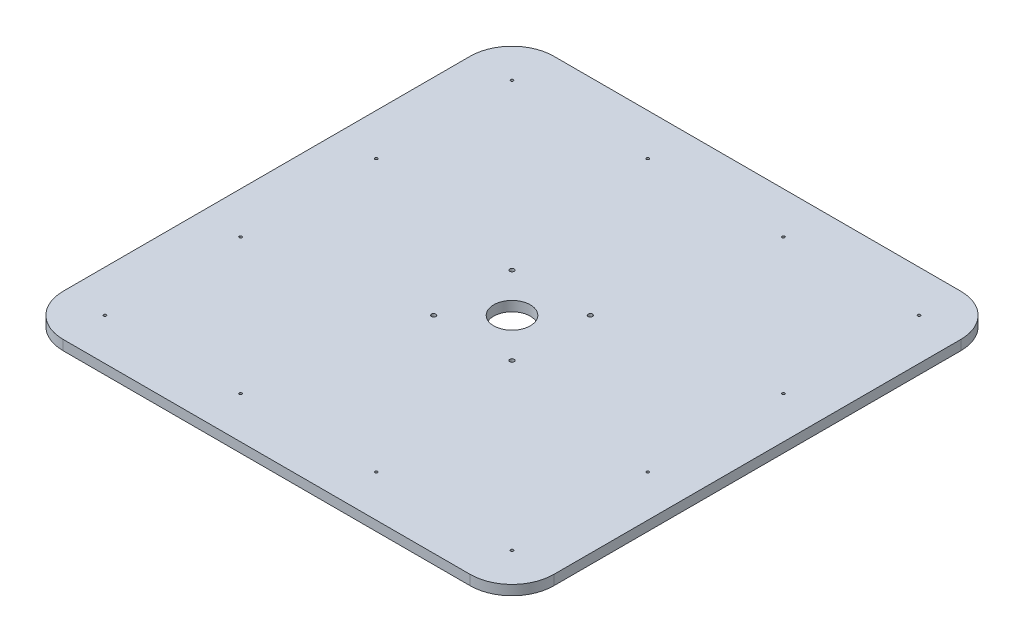
ISO-10303-21;
HEADER;
FILE_DESCRIPTION(('STEP AP214'),'2;1');
FILE_NAME('part.step','',(''),(''),'','','');
FILE_SCHEMA(('AUTOMOTIVE_DESIGN { 1 0 10303 214 1 1 1 1 }'));
ENDSEC;
DATA;
#1=APPLICATION_CONTEXT('core data for automotive mechanical design processes');
#2=APPLICATION_PROTOCOL_DEFINITION('international standard','automotive_design',2000,#1);
#3=PRODUCT_CONTEXT('',#1,'mechanical');
#4=PRODUCT('Part','Part','',(#3));
#5=PRODUCT_RELATED_PRODUCT_CATEGORY('part','',(#4));
#6=PRODUCT_DEFINITION_FORMATION('','',#4);
#7=PRODUCT_DEFINITION_CONTEXT('part definition',#1,'design');
#8=PRODUCT_DEFINITION('design','',#6,#7);
#9=PRODUCT_DEFINITION_SHAPE('','',#8);
#10=(LENGTH_UNIT() NAMED_UNIT(*) SI_UNIT(.MILLI.,.METRE.));
#11=(NAMED_UNIT(*) PLANE_ANGLE_UNIT() SI_UNIT($,.RADIAN.));
#12=(NAMED_UNIT(*) SI_UNIT($,.STERADIAN.) SOLID_ANGLE_UNIT());
#13=UNCERTAINTY_MEASURE_WITH_UNIT(LENGTH_MEASURE(1.E-05),#10,'distance_accuracy_value','');
#14=(GEOMETRIC_REPRESENTATION_CONTEXT(3) GLOBAL_UNCERTAINTY_ASSIGNED_CONTEXT((#13)) GLOBAL_UNIT_ASSIGNED_CONTEXT((#10,
#11,#12)) REPRESENTATION_CONTEXT('',''));
#15=CARTESIAN_POINT('',(0.,0.,0.));
#16=DIRECTION('',(0.,0.,1.));
#17=DIRECTION('',(1.,0.,0.));
#18=AXIS2_PLACEMENT_3D('',#15,#16,#17);
#19=CARTESIAN_POINT('',(0.,12.,0.));
#20=DIRECTION('',(0.,1.,0.));
#21=DIRECTION('',(0.,0.,1.));
#22=AXIS2_PLACEMENT_3D('',#19,#20,#21);
#23=PLANE('',#22);
#24=CARTESIAN_POINT('',(0.,12.,1.11022302462516E-13));
#25=DIRECTION('',(0.,-1.,0.));
#26=DIRECTION('',(0.,0.,-1.));
#27=AXIS2_PLACEMENT_3D('',#24,#25,#26);
#28=CIRCLE('',#27,22.225);
#29=CARTESIAN_POINT('',(0.,12.,-22.2249999999999));
#30=VERTEX_POINT('',#29);
#31=EDGE_CURVE('E110',#30,#30,#28,.T.);
#32=ORIENTED_EDGE('',*,*,#31,.T.);
#33=EDGE_LOOP('',(#32));
#34=FACE_BOUND('',#33,.T.);
#35=DIRECTION('',(0.,0.,1.));
#36=VECTOR('',#35,1.);
#37=CARTESIAN_POINT('',(298.45,12.,298.45));
#38=LINE('',#37,#36);
#39=CARTESIAN_POINT('',(298.45,12.,247.65));
#40=VERTEX_POINT('',#39);
#41=CARTESIAN_POINT('',(298.45,12.,-247.65));
#42=VERTEX_POINT('',#41);
#43=EDGE_CURVE('E116',#40,#42,#38,.F.);
#44=ORIENTED_EDGE('',*,*,#43,.T.);
#45=CARTESIAN_POINT('',(247.65,12.,-247.65));
#46=DIRECTION('',(0.,-1.,0.));
#47=DIRECTION('',(0.,0.,-1.));
#48=AXIS2_PLACEMENT_3D('',#45,#46,#47);
#49=CIRCLE('',#48,50.8);
#50=CARTESIAN_POINT('',(247.65,12.,-298.45));
#51=VERTEX_POINT('',#50);
#52=EDGE_CURVE('E117',#51,#42,#49,.T.);
#53=ORIENTED_EDGE('',*,*,#52,.F.);
#54=DIRECTION('',(1.,0.,0.));
#55=VECTOR('',#54,1.);
#56=CARTESIAN_POINT('',(298.45,12.,-298.45));
#57=LINE('',#56,#55);
#58=CARTESIAN_POINT('',(-247.65,12.,-298.45));
#59=VERTEX_POINT('',#58);
#60=EDGE_CURVE('E111',#51,#59,#57,.F.);
#61=ORIENTED_EDGE('',*,*,#60,.T.);
#62=CARTESIAN_POINT('',(-247.65,12.,-247.65));
#63=DIRECTION('',(0.,-1.,0.));
#64=DIRECTION('',(0.,0.,-1.));
#65=AXIS2_PLACEMENT_3D('',#62,#63,#64);
#66=CIRCLE('',#65,50.8);
#67=CARTESIAN_POINT('',(-298.45,12.,-247.65));
#68=VERTEX_POINT('',#67);
#69=EDGE_CURVE('E114',#68,#59,#66,.T.);
#70=ORIENTED_EDGE('',*,*,#69,.F.);
#71=DIRECTION('',(0.,0.,-1.));
#72=VECTOR('',#71,1.);
#73=CARTESIAN_POINT('',(-298.45,12.,298.45));
#74=LINE('',#73,#72);
#75=CARTESIAN_POINT('',(-298.45,12.,247.65));
#76=VERTEX_POINT('',#75);
#77=EDGE_CURVE('E87',#68,#76,#74,.F.);
#78=ORIENTED_EDGE('',*,*,#77,.T.);
#79=CARTESIAN_POINT('',(-247.65,12.,247.65));
#80=DIRECTION('',(0.,-1.,0.));
#81=DIRECTION('',(0.,0.,-1.));
#82=AXIS2_PLACEMENT_3D('',#79,#80,#81);
#83=CIRCLE('',#82,50.8);
#84=CARTESIAN_POINT('',(-247.65,12.,298.45));
#85=VERTEX_POINT('',#84);
#86=EDGE_CURVE('E81',#85,#76,#83,.T.);
#87=ORIENTED_EDGE('',*,*,#86,.F.);
#88=DIRECTION('',(-1.,0.,0.));
#89=VECTOR('',#88,1.);
#90=CARTESIAN_POINT('',(298.45,12.,298.45));
#91=LINE('',#90,#89);
#92=CARTESIAN_POINT('',(247.65,12.,298.45));
#93=VERTEX_POINT('',#92);
#94=EDGE_CURVE('E85',#85,#93,#91,.F.);
#95=ORIENTED_EDGE('',*,*,#94,.T.);
#96=CARTESIAN_POINT('',(247.65,12.,247.65));
#97=DIRECTION('',(0.,-1.,0.));
#98=DIRECTION('',(0.,0.,-1.));
#99=AXIS2_PLACEMENT_3D('',#96,#97,#98);
#100=CIRCLE('',#99,50.8);
#101=EDGE_CURVE('E100',#40,#93,#100,.T.);
#102=ORIENTED_EDGE('',*,*,#101,.F.);
#103=EDGE_LOOP('',(#44,#53,#61,#70,#78,#87,#95,#102));
#104=FACE_BOUND('',#103,.T.);
#105=CARTESIAN_POINT('',(-247.65,12.,247.65));
#106=DIRECTION('',(0.,-1.,0.));
#107=DIRECTION('',(0.,0.,-1.));
#108=AXIS2_PLACEMENT_3D('',#105,#106,#107);
#109=CIRCLE('',#108,1.65100000000001);
#110=CARTESIAN_POINT('',(-247.65,12.,245.999));
#111=VERTEX_POINT('',#110);
#112=EDGE_CURVE('E93',#111,#111,#109,.T.);
#113=ORIENTED_EDGE('',*,*,#112,.T.);
#114=EDGE_LOOP('',(#113));
#115=FACE_BOUND('',#114,.T.);
#116=CARTESIAN_POINT('',(-82.55,12.,247.65));
#117=DIRECTION('',(0.,-1.,0.));
#118=DIRECTION('',(0.,0.,-1.));
#119=AXIS2_PLACEMENT_3D('',#116,#117,#118);
#120=CIRCLE('',#119,1.65100000000001);
#121=CARTESIAN_POINT('',(-82.55,12.,245.999));
#122=VERTEX_POINT('',#121);
#123=EDGE_CURVE('E190',#122,#122,#120,.T.);
#124=ORIENTED_EDGE('',*,*,#123,.T.);
#125=EDGE_LOOP('',(#124));
#126=FACE_BOUND('',#125,.T.);
#127=CARTESIAN_POINT('',(82.55,12.,247.65));
#128=DIRECTION('',(0.,-1.,0.));
#129=DIRECTION('',(0.,0.,-1.));
#130=AXIS2_PLACEMENT_3D('',#127,#128,#129);
#131=CIRCLE('',#130,1.65100000000001);
#132=CARTESIAN_POINT('',(82.55,12.,245.999));
#133=VERTEX_POINT('',#132);
#134=EDGE_CURVE('E193',#133,#133,#131,.T.);
#135=ORIENTED_EDGE('',*,*,#134,.T.);
#136=EDGE_LOOP('',(#135));
#137=FACE_BOUND('',#136,.T.);
#138=CARTESIAN_POINT('',(247.65,12.,247.65));
#139=DIRECTION('',(0.,-1.,0.));
#140=DIRECTION('',(0.,0.,-1.));
#141=AXIS2_PLACEMENT_3D('',#138,#139,#140);
#142=CIRCLE('',#141,1.65100000000001);
#143=CARTESIAN_POINT('',(247.65,12.,245.999));
#144=VERTEX_POINT('',#143);
#145=EDGE_CURVE('E196',#144,#144,#142,.T.);
#146=ORIENTED_EDGE('',*,*,#145,.T.);
#147=EDGE_LOOP('',(#146));
#148=FACE_BOUND('',#147,.T.);
#149=CARTESIAN_POINT('',(247.65,12.,-82.5499999999999));
#150=DIRECTION('',(0.,-1.,0.));
#151=DIRECTION('',(0.,0.,-1.));
#152=AXIS2_PLACEMENT_3D('',#149,#150,#151);
#153=CIRCLE('',#152,1.65100000000001);
#154=CARTESIAN_POINT('',(247.65,12.,-84.2009999999999));
#155=VERTEX_POINT('',#154);
#156=EDGE_CURVE('E199',#155,#155,#153,.T.);
#157=ORIENTED_EDGE('',*,*,#156,.T.);
#158=EDGE_LOOP('',(#157));
#159=FACE_BOUND('',#158,.T.);
#160=CARTESIAN_POINT('',(247.65,12.,82.5499999999999));
#161=DIRECTION('',(0.,-1.,0.));
#162=DIRECTION('',(0.,0.,-1.));
#163=AXIS2_PLACEMENT_3D('',#160,#161,#162);
#164=CIRCLE('',#163,1.65100000000001);
#165=CARTESIAN_POINT('',(247.65,12.,80.8989999999999));
#166=VERTEX_POINT('',#165);
#167=EDGE_CURVE('E202',#166,#166,#164,.T.);
#168=ORIENTED_EDGE('',*,*,#167,.T.);
#169=EDGE_LOOP('',(#168));
#170=FACE_BOUND('',#169,.T.);
#171=CARTESIAN_POINT('',(247.65,12.,-247.65));
#172=DIRECTION('',(0.,-1.,0.));
#173=DIRECTION('',(0.,0.,-1.));
#174=AXIS2_PLACEMENT_3D('',#171,#172,#173);
#175=CIRCLE('',#174,1.65100000000001);
#176=CARTESIAN_POINT('',(247.65,12.,-249.301));
#177=VERTEX_POINT('',#176);
#178=EDGE_CURVE('E205',#177,#177,#175,.T.);
#179=ORIENTED_EDGE('',*,*,#178,.T.);
#180=EDGE_LOOP('',(#179));
#181=FACE_BOUND('',#180,.T.);
#182=CARTESIAN_POINT('',(82.55,12.,-247.65));
#183=DIRECTION('',(0.,-1.,0.));
#184=DIRECTION('',(0.,0.,-1.));
#185=AXIS2_PLACEMENT_3D('',#182,#183,#184);
#186=CIRCLE('',#185,1.65100000000001);
#187=CARTESIAN_POINT('',(82.55,12.,-249.301));
#188=VERTEX_POINT('',#187);
#189=EDGE_CURVE('E208',#188,#188,#186,.T.);
#190=ORIENTED_EDGE('',*,*,#189,.T.);
#191=EDGE_LOOP('',(#190));
#192=FACE_BOUND('',#191,.T.);
#193=CARTESIAN_POINT('',(-82.55,12.,-247.65));
#194=DIRECTION('',(0.,-1.,0.));
#195=DIRECTION('',(0.,0.,-1.));
#196=AXIS2_PLACEMENT_3D('',#193,#194,#195);
#197=CIRCLE('',#196,1.65100000000001);
#198=CARTESIAN_POINT('',(-82.55,12.,-249.301));
#199=VERTEX_POINT('',#198);
#200=EDGE_CURVE('E211',#199,#199,#197,.T.);
#201=ORIENTED_EDGE('',*,*,#200,.T.);
#202=EDGE_LOOP('',(#201));
#203=FACE_BOUND('',#202,.T.);
#204=CARTESIAN_POINT('',(-247.65,12.,-247.65));
#205=DIRECTION('',(0.,-1.,0.));
#206=DIRECTION('',(0.,0.,-1.));
#207=AXIS2_PLACEMENT_3D('',#204,#205,#206);
#208=CIRCLE('',#207,1.65100000000001);
#209=CARTESIAN_POINT('',(-247.65,12.,-249.301));
#210=VERTEX_POINT('',#209);
#211=EDGE_CURVE('E214',#210,#210,#208,.T.);
#212=ORIENTED_EDGE('',*,*,#211,.T.);
#213=EDGE_LOOP('',(#212));
#214=FACE_BOUND('',#213,.T.);
#215=CARTESIAN_POINT('',(-247.65,12.,-82.5499999999999));
#216=DIRECTION('',(0.,-1.,0.));
#217=DIRECTION('',(0.,0.,-1.));
#218=AXIS2_PLACEMENT_3D('',#215,#216,#217);
#219=CIRCLE('',#218,1.65100000000001);
#220=CARTESIAN_POINT('',(-247.65,12.,-84.2009999999999));
#221=VERTEX_POINT('',#220);
#222=EDGE_CURVE('E217',#221,#221,#219,.T.);
#223=ORIENTED_EDGE('',*,*,#222,.T.);
#224=EDGE_LOOP('',(#223));
#225=FACE_BOUND('',#224,.T.);
#226=CARTESIAN_POINT('',(-247.65,12.,82.5499999999999));
#227=DIRECTION('',(0.,-1.,0.));
#228=DIRECTION('',(0.,0.,-1.));
#229=AXIS2_PLACEMENT_3D('',#226,#227,#228);
#230=CIRCLE('',#229,1.65100000000001);
#231=CARTESIAN_POINT('',(-247.65,12.,80.8989999999999));
#232=VERTEX_POINT('',#231);
#233=EDGE_CURVE('E220',#232,#232,#230,.T.);
#234=ORIENTED_EDGE('',*,*,#233,.T.);
#235=EDGE_LOOP('',(#234));
#236=FACE_BOUND('',#235,.T.);
#237=CARTESIAN_POINT('',(-47.625,12.,-47.625));
#238=DIRECTION('',(0.,-1.,0.));
#239=DIRECTION('',(0.,0.,-1.));
#240=AXIS2_PLACEMENT_3D('',#237,#238,#239);
#241=CIRCLE('',#240,2.667);
#242=CARTESIAN_POINT('',(-47.625,12.,-50.292));
#243=VERTEX_POINT('',#242);
#244=EDGE_CURVE('E223',#243,#243,#241,.T.);
#245=ORIENTED_EDGE('',*,*,#244,.T.);
#246=EDGE_LOOP('',(#245));
#247=FACE_BOUND('',#246,.T.);
#248=CARTESIAN_POINT('',(47.625,12.,-47.625));
#249=DIRECTION('',(0.,-1.,0.));
#250=DIRECTION('',(0.,0.,-1.));
#251=AXIS2_PLACEMENT_3D('',#248,#249,#250);
#252=CIRCLE('',#251,2.667);
#253=CARTESIAN_POINT('',(47.625,12.,-50.292));
#254=VERTEX_POINT('',#253);
#255=EDGE_CURVE('E226',#254,#254,#252,.T.);
#256=ORIENTED_EDGE('',*,*,#255,.T.);
#257=EDGE_LOOP('',(#256));
#258=FACE_BOUND('',#257,.T.);
#259=CARTESIAN_POINT('',(47.625,12.,47.625));
#260=DIRECTION('',(0.,-1.,0.));
#261=DIRECTION('',(0.,0.,-1.));
#262=AXIS2_PLACEMENT_3D('',#259,#260,#261);
#263=CIRCLE('',#262,2.667);
#264=CARTESIAN_POINT('',(47.625,12.,44.958));
#265=VERTEX_POINT('',#264);
#266=EDGE_CURVE('E228',#265,#265,#263,.T.);
#267=ORIENTED_EDGE('',*,*,#266,.T.);
#268=EDGE_LOOP('',(#267));
#269=FACE_BOUND('',#268,.T.);
#270=CARTESIAN_POINT('',(-47.625,12.,47.625));
#271=DIRECTION('',(0.,-1.,0.));
#272=DIRECTION('',(0.,0.,-1.));
#273=AXIS2_PLACEMENT_3D('',#270,#271,#272);
#274=CIRCLE('',#273,2.667);
#275=CARTESIAN_POINT('',(-47.625,12.,44.958));
#276=VERTEX_POINT('',#275);
#277=EDGE_CURVE('E20',#276,#276,#274,.T.);
#278=ORIENTED_EDGE('',*,*,#277,.T.);
#279=EDGE_LOOP('',(#278));
#280=FACE_BOUND('',#279,.T.);
#281=ADVANCED_FACE('F17',(#34,#104,#115,#126,#137,#148,#159,#170,#181,#192,#203,#214,#225,#236,
#247,#258,#269,#280),#23,.T.);
#282=CARTESIAN_POINT('',(-47.625,12.,47.625));
#283=DIRECTION('',(0.,-1.,0.));
#284=DIRECTION('',(0.,0.,-1.));
#285=AXIS2_PLACEMENT_3D('',#282,#283,#284);
#286=CYLINDRICAL_SURFACE('',#285,2.667);
#287=ORIENTED_EDGE('',*,*,#277,.F.);
#288=EDGE_LOOP('',(#287));
#289=FACE_BOUND('',#288,.T.);
#290=CARTESIAN_POINT('',(-47.625,0.,47.625));
#291=DIRECTION('',(0.,-1.,0.));
#292=DIRECTION('',(0.,0.,-1.));
#293=AXIS2_PLACEMENT_3D('',#290,#291,#292);
#294=CIRCLE('',#293,2.667);
#295=CARTESIAN_POINT('',(-47.625,0.,44.958));
#296=VERTEX_POINT('',#295);
#297=EDGE_CURVE('E178',#296,#296,#294,.T.);
#298=ORIENTED_EDGE('',*,*,#297,.T.);
#299=EDGE_LOOP('',(#298));
#300=FACE_BOUND('',#299,.T.);
#301=ADVANCED_FACE('F236',(#289,#300),#286,.F.);
#302=CARTESIAN_POINT('',(47.625,12.,47.625));
#303=DIRECTION('',(0.,-1.,0.));
#304=DIRECTION('',(0.,0.,-1.));
#305=AXIS2_PLACEMENT_3D('',#302,#303,#304);
#306=CYLINDRICAL_SURFACE('',#305,2.667);
#307=ORIENTED_EDGE('',*,*,#266,.F.);
#308=EDGE_LOOP('',(#307));
#309=FACE_BOUND('',#308,.T.);
#310=CARTESIAN_POINT('',(47.625,0.,47.625));
#311=DIRECTION('',(0.,-1.,0.));
#312=DIRECTION('',(0.,0.,-1.));
#313=AXIS2_PLACEMENT_3D('',#310,#311,#312);
#314=CIRCLE('',#313,2.667);
#315=CARTESIAN_POINT('',(47.625,0.,44.958));
#316=VERTEX_POINT('',#315);
#317=EDGE_CURVE('E175',#316,#316,#314,.T.);
#318=ORIENTED_EDGE('',*,*,#317,.T.);
#319=EDGE_LOOP('',(#318));
#320=FACE_BOUND('',#319,.T.);
#321=ADVANCED_FACE('F239',(#309,#320),#306,.F.);
#322=CARTESIAN_POINT('',(47.625,12.,-47.625));
#323=DIRECTION('',(0.,-1.,0.));
#324=DIRECTION('',(0.,0.,-1.));
#325=AXIS2_PLACEMENT_3D('',#322,#323,#324);
#326=CYLINDRICAL_SURFACE('',#325,2.667);
#327=ORIENTED_EDGE('',*,*,#255,.F.);
#328=EDGE_LOOP('',(#327));
#329=FACE_BOUND('',#328,.T.);
#330=CARTESIAN_POINT('',(47.625,0.,-47.625));
#331=DIRECTION('',(0.,-1.,0.));
#332=DIRECTION('',(0.,0.,-1.));
#333=AXIS2_PLACEMENT_3D('',#330,#331,#332);
#334=CIRCLE('',#333,2.667);
#335=CARTESIAN_POINT('',(47.625,0.,-50.292));
#336=VERTEX_POINT('',#335);
#337=EDGE_CURVE('E172',#336,#336,#334,.T.);
#338=ORIENTED_EDGE('',*,*,#337,.T.);
#339=EDGE_LOOP('',(#338));
#340=FACE_BOUND('',#339,.T.);
#341=ADVANCED_FACE('F334',(#329,#340),#326,.F.);
#342=CARTESIAN_POINT('',(-47.625,12.,-47.625));
#343=DIRECTION('',(0.,-1.,0.));
#344=DIRECTION('',(0.,0.,-1.));
#345=AXIS2_PLACEMENT_3D('',#342,#343,#344);
#346=CYLINDRICAL_SURFACE('',#345,2.667);
#347=ORIENTED_EDGE('',*,*,#244,.F.);
#348=EDGE_LOOP('',(#347));
#349=FACE_BOUND('',#348,.T.);
#350=CARTESIAN_POINT('',(-47.625,0.,-47.625));
#351=DIRECTION('',(0.,-1.,0.));
#352=DIRECTION('',(0.,0.,-1.));
#353=AXIS2_PLACEMENT_3D('',#350,#351,#352);
#354=CIRCLE('',#353,2.667);
#355=CARTESIAN_POINT('',(-47.625,0.,-50.292));
#356=VERTEX_POINT('',#355);
#357=EDGE_CURVE('E169',#356,#356,#354,.T.);
#358=ORIENTED_EDGE('',*,*,#357,.T.);
#359=EDGE_LOOP('',(#358));
#360=FACE_BOUND('',#359,.T.);
#361=ADVANCED_FACE('F330',(#349,#360),#346,.F.);
#362=CARTESIAN_POINT('',(-247.65,12.,82.5499999999999));
#363=DIRECTION('',(0.,-1.,0.));
#364=DIRECTION('',(0.,0.,-1.));
#365=AXIS2_PLACEMENT_3D('',#362,#363,#364);
#366=CYLINDRICAL_SURFACE('',#365,1.65100000000001);
#367=ORIENTED_EDGE('',*,*,#233,.F.);
#368=EDGE_LOOP('',(#367));
#369=FACE_BOUND('',#368,.T.);
#370=CARTESIAN_POINT('',(-247.65,0.,82.5499999999999));
#371=DIRECTION('',(0.,-1.,0.));
#372=DIRECTION('',(0.,0.,-1.));
#373=AXIS2_PLACEMENT_3D('',#370,#371,#372);
#374=CIRCLE('',#373,1.65100000000001);
#375=CARTESIAN_POINT('',(-247.65,0.,80.8989999999999));
#376=VERTEX_POINT('',#375);
#377=EDGE_CURVE('E166',#376,#376,#374,.T.);
#378=ORIENTED_EDGE('',*,*,#377,.T.);
#379=EDGE_LOOP('',(#378));
#380=FACE_BOUND('',#379,.T.);
#381=ADVANCED_FACE('F326',(#369,#380),#366,.F.);
#382=CARTESIAN_POINT('',(-247.65,12.,-82.5499999999999));
#383=DIRECTION('',(0.,-1.,0.));
#384=DIRECTION('',(0.,0.,-1.));
#385=AXIS2_PLACEMENT_3D('',#382,#383,#384);
#386=CYLINDRICAL_SURFACE('',#385,1.65100000000001);
#387=ORIENTED_EDGE('',*,*,#222,.F.);
#388=EDGE_LOOP('',(#387));
#389=FACE_BOUND('',#388,.T.);
#390=CARTESIAN_POINT('',(-247.65,0.,-82.5499999999999));
#391=DIRECTION('',(0.,-1.,0.));
#392=DIRECTION('',(0.,0.,-1.));
#393=AXIS2_PLACEMENT_3D('',#390,#391,#392);
#394=CIRCLE('',#393,1.65100000000001);
#395=CARTESIAN_POINT('',(-247.65,0.,-84.2009999999999));
#396=VERTEX_POINT('',#395);
#397=EDGE_CURVE('E163',#396,#396,#394,.T.);
#398=ORIENTED_EDGE('',*,*,#397,.T.);
#399=EDGE_LOOP('',(#398));
#400=FACE_BOUND('',#399,.T.);
#401=ADVANCED_FACE('F322',(#389,#400),#386,.F.);
#402=CARTESIAN_POINT('',(-247.65,12.,-247.65));
#403=DIRECTION('',(0.,-1.,0.));
#404=DIRECTION('',(0.,0.,-1.));
#405=AXIS2_PLACEMENT_3D('',#402,#403,#404);
#406=CYLINDRICAL_SURFACE('',#405,1.65100000000001);
#407=ORIENTED_EDGE('',*,*,#211,.F.);
#408=EDGE_LOOP('',(#407));
#409=FACE_BOUND('',#408,.T.);
#410=CARTESIAN_POINT('',(-247.65,0.,-247.65));
#411=DIRECTION('',(0.,-1.,0.));
#412=DIRECTION('',(0.,0.,-1.));
#413=AXIS2_PLACEMENT_3D('',#410,#411,#412);
#414=CIRCLE('',#413,1.65100000000001);
#415=CARTESIAN_POINT('',(-247.65,0.,-249.301));
#416=VERTEX_POINT('',#415);
#417=EDGE_CURVE('E160',#416,#416,#414,.T.);
#418=ORIENTED_EDGE('',*,*,#417,.T.);
#419=EDGE_LOOP('',(#418));
#420=FACE_BOUND('',#419,.T.);
#421=ADVANCED_FACE('F318',(#409,#420),#406,.F.);
#422=CARTESIAN_POINT('',(-82.55,12.,-247.65));
#423=DIRECTION('',(0.,-1.,0.));
#424=DIRECTION('',(0.,0.,-1.));
#425=AXIS2_PLACEMENT_3D('',#422,#423,#424);
#426=CYLINDRICAL_SURFACE('',#425,1.65100000000001);
#427=ORIENTED_EDGE('',*,*,#200,.F.);
#428=EDGE_LOOP('',(#427));
#429=FACE_BOUND('',#428,.T.);
#430=CARTESIAN_POINT('',(-82.55,0.,-247.65));
#431=DIRECTION('',(0.,-1.,0.));
#432=DIRECTION('',(0.,0.,-1.));
#433=AXIS2_PLACEMENT_3D('',#430,#431,#432);
#434=CIRCLE('',#433,1.65100000000001);
#435=CARTESIAN_POINT('',(-82.55,0.,-249.301));
#436=VERTEX_POINT('',#435);
#437=EDGE_CURVE('E157',#436,#436,#434,.T.);
#438=ORIENTED_EDGE('',*,*,#437,.T.);
#439=EDGE_LOOP('',(#438));
#440=FACE_BOUND('',#439,.T.);
#441=ADVANCED_FACE('F314',(#429,#440),#426,.F.);
#442=CARTESIAN_POINT('',(82.55,12.,-247.65));
#443=DIRECTION('',(0.,-1.,0.));
#444=DIRECTION('',(0.,0.,-1.));
#445=AXIS2_PLACEMENT_3D('',#442,#443,#444);
#446=CYLINDRICAL_SURFACE('',#445,1.65100000000001);
#447=ORIENTED_EDGE('',*,*,#189,.F.);
#448=EDGE_LOOP('',(#447));
#449=FACE_BOUND('',#448,.T.);
#450=CARTESIAN_POINT('',(82.55,0.,-247.65));
#451=DIRECTION('',(0.,-1.,0.));
#452=DIRECTION('',(0.,0.,-1.));
#453=AXIS2_PLACEMENT_3D('',#450,#451,#452);
#454=CIRCLE('',#453,1.65100000000001);
#455=CARTESIAN_POINT('',(82.55,0.,-249.301));
#456=VERTEX_POINT('',#455);
#457=EDGE_CURVE('E154',#456,#456,#454,.T.);
#458=ORIENTED_EDGE('',*,*,#457,.T.);
#459=EDGE_LOOP('',(#458));
#460=FACE_BOUND('',#459,.T.);
#461=ADVANCED_FACE('F310',(#449,#460),#446,.F.);
#462=CARTESIAN_POINT('',(247.65,12.,-247.65));
#463=DIRECTION('',(0.,-1.,0.));
#464=DIRECTION('',(0.,0.,-1.));
#465=AXIS2_PLACEMENT_3D('',#462,#463,#464);
#466=CYLINDRICAL_SURFACE('',#465,1.65100000000001);
#467=ORIENTED_EDGE('',*,*,#178,.F.);
#468=EDGE_LOOP('',(#467));
#469=FACE_BOUND('',#468,.T.);
#470=CARTESIAN_POINT('',(247.65,0.,-247.65));
#471=DIRECTION('',(0.,-1.,0.));
#472=DIRECTION('',(0.,0.,-1.));
#473=AXIS2_PLACEMENT_3D('',#470,#471,#472);
#474=CIRCLE('',#473,1.65100000000001);
#475=CARTESIAN_POINT('',(247.65,0.,-249.301));
#476=VERTEX_POINT('',#475);
#477=EDGE_CURVE('E151',#476,#476,#474,.T.);
#478=ORIENTED_EDGE('',*,*,#477,.T.);
#479=EDGE_LOOP('',(#478));
#480=FACE_BOUND('',#479,.T.);
#481=ADVANCED_FACE('F306',(#469,#480),#466,.F.);
#482=CARTESIAN_POINT('',(247.65,12.,82.5499999999999));
#483=DIRECTION('',(0.,-1.,0.));
#484=DIRECTION('',(0.,0.,-1.));
#485=AXIS2_PLACEMENT_3D('',#482,#483,#484);
#486=CYLINDRICAL_SURFACE('',#485,1.65100000000001);
#487=ORIENTED_EDGE('',*,*,#167,.F.);
#488=EDGE_LOOP('',(#487));
#489=FACE_BOUND('',#488,.T.);
#490=CARTESIAN_POINT('',(247.65,0.,82.5499999999999));
#491=DIRECTION('',(0.,-1.,0.));
#492=DIRECTION('',(0.,0.,-1.));
#493=AXIS2_PLACEMENT_3D('',#490,#491,#492);
#494=CIRCLE('',#493,1.65100000000001);
#495=CARTESIAN_POINT('',(247.65,0.,80.8989999999999));
#496=VERTEX_POINT('',#495);
#497=EDGE_CURVE('E148',#496,#496,#494,.T.);
#498=ORIENTED_EDGE('',*,*,#497,.T.);
#499=EDGE_LOOP('',(#498));
#500=FACE_BOUND('',#499,.T.);
#501=ADVANCED_FACE('F302',(#489,#500),#486,.F.);
#502=CARTESIAN_POINT('',(247.65,12.,-82.5499999999999));
#503=DIRECTION('',(0.,-1.,0.));
#504=DIRECTION('',(0.,0.,-1.));
#505=AXIS2_PLACEMENT_3D('',#502,#503,#504);
#506=CYLINDRICAL_SURFACE('',#505,1.65100000000001);
#507=ORIENTED_EDGE('',*,*,#156,.F.);
#508=EDGE_LOOP('',(#507));
#509=FACE_BOUND('',#508,.T.);
#510=CARTESIAN_POINT('',(247.65,0.,-82.5499999999999));
#511=DIRECTION('',(0.,-1.,0.));
#512=DIRECTION('',(0.,0.,-1.));
#513=AXIS2_PLACEMENT_3D('',#510,#511,#512);
#514=CIRCLE('',#513,1.65100000000001);
#515=CARTESIAN_POINT('',(247.65,0.,-84.2009999999999));
#516=VERTEX_POINT('',#515);
#517=EDGE_CURVE('E145',#516,#516,#514,.T.);
#518=ORIENTED_EDGE('',*,*,#517,.T.);
#519=EDGE_LOOP('',(#518));
#520=FACE_BOUND('',#519,.T.);
#521=ADVANCED_FACE('F298',(#509,#520),#506,.F.);
#522=CARTESIAN_POINT('',(247.65,12.,247.65));
#523=DIRECTION('',(0.,-1.,0.));
#524=DIRECTION('',(0.,0.,-1.));
#525=AXIS2_PLACEMENT_3D('',#522,#523,#524);
#526=CYLINDRICAL_SURFACE('',#525,1.65100000000001);
#527=ORIENTED_EDGE('',*,*,#145,.F.);
#528=EDGE_LOOP('',(#527));
#529=FACE_BOUND('',#528,.T.);
#530=CARTESIAN_POINT('',(247.65,0.,247.65));
#531=DIRECTION('',(0.,-1.,0.));
#532=DIRECTION('',(0.,0.,-1.));
#533=AXIS2_PLACEMENT_3D('',#530,#531,#532);
#534=CIRCLE('',#533,1.65100000000001);
#535=CARTESIAN_POINT('',(247.65,0.,245.999));
#536=VERTEX_POINT('',#535);
#537=EDGE_CURVE('E142',#536,#536,#534,.T.);
#538=ORIENTED_EDGE('',*,*,#537,.T.);
#539=EDGE_LOOP('',(#538));
#540=FACE_BOUND('',#539,.T.);
#541=ADVANCED_FACE('F294',(#529,#540),#526,.F.);
#542=CARTESIAN_POINT('',(82.55,12.,247.65));
#543=DIRECTION('',(0.,-1.,0.));
#544=DIRECTION('',(0.,0.,-1.));
#545=AXIS2_PLACEMENT_3D('',#542,#543,#544);
#546=CYLINDRICAL_SURFACE('',#545,1.65100000000001);
#547=ORIENTED_EDGE('',*,*,#134,.F.);
#548=EDGE_LOOP('',(#547));
#549=FACE_BOUND('',#548,.T.);
#550=CARTESIAN_POINT('',(82.55,0.,247.65));
#551=DIRECTION('',(0.,-1.,0.));
#552=DIRECTION('',(0.,0.,-1.));
#553=AXIS2_PLACEMENT_3D('',#550,#551,#552);
#554=CIRCLE('',#553,1.65100000000001);
#555=CARTESIAN_POINT('',(82.55,0.,245.999));
#556=VERTEX_POINT('',#555);
#557=EDGE_CURVE('E139',#556,#556,#554,.T.);
#558=ORIENTED_EDGE('',*,*,#557,.T.);
#559=EDGE_LOOP('',(#558));
#560=FACE_BOUND('',#559,.T.);
#561=ADVANCED_FACE('F290',(#549,#560),#546,.F.);
#562=CARTESIAN_POINT('',(-82.55,12.,247.65));
#563=DIRECTION('',(0.,-1.,0.));
#564=DIRECTION('',(0.,0.,-1.));
#565=AXIS2_PLACEMENT_3D('',#562,#563,#564);
#566=CYLINDRICAL_SURFACE('',#565,1.65100000000001);
#567=ORIENTED_EDGE('',*,*,#123,.F.);
#568=EDGE_LOOP('',(#567));
#569=FACE_BOUND('',#568,.T.);
#570=CARTESIAN_POINT('',(-82.55,0.,247.65));
#571=DIRECTION('',(0.,-1.,0.));
#572=DIRECTION('',(0.,0.,-1.));
#573=AXIS2_PLACEMENT_3D('',#570,#571,#572);
#574=CIRCLE('',#573,1.65100000000001);
#575=CARTESIAN_POINT('',(-82.55,0.,245.999));
#576=VERTEX_POINT('',#575);
#577=EDGE_CURVE('E136',#576,#576,#574,.T.);
#578=ORIENTED_EDGE('',*,*,#577,.T.);
#579=EDGE_LOOP('',(#578));
#580=FACE_BOUND('',#579,.T.);
#581=ADVANCED_FACE('F286',(#569,#580),#566,.F.);
#582=CARTESIAN_POINT('',(-247.65,12.,247.65));
#583=DIRECTION('',(0.,-1.,0.));
#584=DIRECTION('',(0.,0.,-1.));
#585=AXIS2_PLACEMENT_3D('',#582,#583,#584);
#586=CYLINDRICAL_SURFACE('',#585,1.65100000000001);
#587=ORIENTED_EDGE('',*,*,#112,.F.);
#588=EDGE_LOOP('',(#587));
#589=FACE_BOUND('',#588,.T.);
#590=CARTESIAN_POINT('',(-247.65,0.,247.65));
#591=DIRECTION('',(0.,-1.,0.));
#592=DIRECTION('',(0.,0.,-1.));
#593=AXIS2_PLACEMENT_3D('',#590,#591,#592);
#594=CIRCLE('',#593,1.65100000000001);
#595=CARTESIAN_POINT('',(-247.65,0.,245.999));
#596=VERTEX_POINT('',#595);
#597=EDGE_CURVE('E133',#596,#596,#594,.T.);
#598=ORIENTED_EDGE('',*,*,#597,.T.);
#599=EDGE_LOOP('',(#598));
#600=FACE_BOUND('',#599,.T.);
#601=ADVANCED_FACE('F283',(#589,#600),#586,.F.);
#602=CARTESIAN_POINT('',(-247.65,12.,247.65));
#603=DIRECTION('',(0.,-1.,0.));
#604=DIRECTION('',(0.,0.,-1.));
#605=AXIS2_PLACEMENT_3D('',#602,#603,#604);
#606=CYLINDRICAL_SURFACE('',#605,50.8);
#607=CARTESIAN_POINT('',(-247.65,0.,247.65));
#608=DIRECTION('',(0.,-1.,0.));
#609=DIRECTION('',(0.,0.,-1.));
#610=AXIS2_PLACEMENT_3D('',#607,#608,#609);
#611=CIRCLE('',#610,50.8);
#612=CARTESIAN_POINT('',(-298.45,0.,247.65));
#613=VERTEX_POINT('',#612);
#614=CARTESIAN_POINT('',(-247.65,0.,298.45));
#615=VERTEX_POINT('',#614);
#616=EDGE_CURVE('E104',#613,#615,#611,.F.);
#617=ORIENTED_EDGE('',*,*,#616,.T.);
#618=DIRECTION('',(0.,1.,0.));
#619=VECTOR('',#618,1.);
#620=CARTESIAN_POINT('',(-247.65,12.,298.45));
#621=LINE('',#620,#619);
#622=EDGE_CURVE('E92',#615,#85,#621,.T.);
#623=ORIENTED_EDGE('',*,*,#622,.T.);
#624=ORIENTED_EDGE('',*,*,#86,.T.);
#625=DIRECTION('',(0.,1.,0.));
#626=VECTOR('',#625,1.);
#627=CARTESIAN_POINT('',(-298.45,12.,247.65));
#628=LINE('',#627,#626);
#629=EDGE_CURVE('E595',#76,#613,#628,.F.);
#630=ORIENTED_EDGE('',*,*,#629,.T.);
#631=EDGE_LOOP('',(#617,#623,#624,#630));
#632=FACE_BOUND('',#631,.T.);
#633=ADVANCED_FACE('F103',(#632),#606,.T.);
#634=CARTESIAN_POINT('',(298.45,12.,298.45));
#635=DIRECTION('',(0.,0.,-1.));
#636=DIRECTION('',(-1.,0.,0.));
#637=AXIS2_PLACEMENT_3D('',#634,#635,#636);
#638=PLANE('',#637);
#639=ORIENTED_EDGE('',*,*,#622,.F.);
#640=DIRECTION('',(1.,0.,0.));
#641=VECTOR('',#640,1.);
#642=CARTESIAN_POINT('',(0.,0.,298.45));
#643=LINE('',#642,#641);
#644=CARTESIAN_POINT('',(247.65,0.,298.45));
#645=VERTEX_POINT('',#644);
#646=EDGE_CURVE('E131',#615,#645,#643,.T.);
#647=ORIENTED_EDGE('',*,*,#646,.T.);
#648=DIRECTION('',(0.,-1.,0.));
#649=VECTOR('',#648,1.);
#650=CARTESIAN_POINT('',(247.65,12.,298.45));
#651=LINE('',#650,#649);
#652=EDGE_CURVE('E99',#93,#645,#651,.T.);
#653=ORIENTED_EDGE('',*,*,#652,.F.);
#654=ORIENTED_EDGE('',*,*,#94,.F.);
#655=EDGE_LOOP('',(#639,#647,#653,#654));
#656=FACE_BOUND('',#655,.T.);
#657=ADVANCED_FACE('F96',(#656),#638,.F.);
#658=CARTESIAN_POINT('',(247.65,12.,247.65));
#659=DIRECTION('',(0.,-1.,0.));
#660=DIRECTION('',(0.,0.,-1.));
#661=AXIS2_PLACEMENT_3D('',#658,#659,#660);
#662=CYLINDRICAL_SURFACE('',#661,50.8);
#663=CARTESIAN_POINT('',(247.65,0.,247.65));
#664=DIRECTION('',(0.,-1.,0.));
#665=DIRECTION('',(0.,0.,-1.));
#666=AXIS2_PLACEMENT_3D('',#663,#664,#665);
#667=CIRCLE('',#666,50.8);
#668=CARTESIAN_POINT('',(298.45,0.,247.65));
#669=VERTEX_POINT('',#668);
#670=EDGE_CURVE('E128',#645,#669,#667,.F.);
#671=ORIENTED_EDGE('',*,*,#670,.T.);
#672=DIRECTION('',(0.,1.,0.));
#673=VECTOR('',#672,1.);
#674=CARTESIAN_POINT('',(298.45,12.,247.65));
#675=LINE('',#674,#673);
#676=EDGE_CURVE('E118',#669,#40,#675,.T.);
#677=ORIENTED_EDGE('',*,*,#676,.T.);
#678=ORIENTED_EDGE('',*,*,#101,.T.);
#679=ORIENTED_EDGE('',*,*,#652,.T.);
#680=EDGE_LOOP('',(#671,#677,#678,#679));
#681=FACE_BOUND('',#680,.T.);
#682=ADVANCED_FACE('F274',(#681),#662,.T.);
#683=CARTESIAN_POINT('',(298.45,12.,298.45));
#684=DIRECTION('',(-1.,0.,0.));
#685=DIRECTION('',(0.,0.,1.));
#686=AXIS2_PLACEMENT_3D('',#683,#684,#685);
#687=PLANE('',#686);
#688=DIRECTION('',(0.,-1.,0.));
#689=VECTOR('',#688,1.);
#690=CARTESIAN_POINT('',(298.45,12.,-247.65));
#691=LINE('',#690,#689);
#692=CARTESIAN_POINT('',(298.45,0.,-247.65));
#693=VERTEX_POINT('',#692);
#694=EDGE_CURVE('E186',#42,#693,#691,.T.);
#695=ORIENTED_EDGE('',*,*,#694,.F.);
#696=ORIENTED_EDGE('',*,*,#43,.F.);
#697=ORIENTED_EDGE('',*,*,#676,.F.);
#698=DIRECTION('',(0.,0.,1.));
#699=VECTOR('',#698,1.);
#700=CARTESIAN_POINT('',(298.45,0.,0.));
#701=LINE('',#700,#699);
#702=EDGE_CURVE('E127',#669,#693,#701,.F.);
#703=ORIENTED_EDGE('',*,*,#702,.T.);
#704=EDGE_LOOP('',(#695,#696,#697,#703));
#705=FACE_BOUND('',#704,.T.);
#706=ADVANCED_FACE('F270',(#705),#687,.F.);
#707=CARTESIAN_POINT('',(247.65,12.,-247.65));
#708=DIRECTION('',(0.,-1.,0.));
#709=DIRECTION('',(0.,0.,-1.));
#710=AXIS2_PLACEMENT_3D('',#707,#708,#709);
#711=CYLINDRICAL_SURFACE('',#710,50.8);
#712=CARTESIAN_POINT('',(247.65,0.,-247.65));
#713=DIRECTION('',(0.,-1.,0.));
#714=DIRECTION('',(0.,0.,-1.));
#715=AXIS2_PLACEMENT_3D('',#712,#713,#714);
#716=CIRCLE('',#715,50.8);
#717=CARTESIAN_POINT('',(247.65,0.,-298.45));
#718=VERTEX_POINT('',#717);
#719=EDGE_CURVE('E124',#693,#718,#716,.F.);
#720=ORIENTED_EDGE('',*,*,#719,.T.);
#721=DIRECTION('',(0.,1.,0.));
#722=VECTOR('',#721,1.);
#723=CARTESIAN_POINT('',(247.65,12.,-298.45));
#724=LINE('',#723,#722);
#725=EDGE_CURVE('E115',#718,#51,#724,.T.);
#726=ORIENTED_EDGE('',*,*,#725,.T.);
#727=ORIENTED_EDGE('',*,*,#52,.T.);
#728=ORIENTED_EDGE('',*,*,#694,.T.);
#729=EDGE_LOOP('',(#720,#726,#727,#728));
#730=FACE_BOUND('',#729,.T.);
#731=ADVANCED_FACE('F266',(#730),#711,.T.);
#732=CARTESIAN_POINT('',(298.45,12.,-298.45));
#733=DIRECTION('',(0.,0.,1.));
#734=DIRECTION('',(1.,0.,0.));
#735=AXIS2_PLACEMENT_3D('',#732,#733,#734);
#736=PLANE('',#735);
#737=DIRECTION('',(0.,-1.,0.));
#738=VECTOR('',#737,1.);
#739=CARTESIAN_POINT('',(-247.65,12.,-298.45));
#740=LINE('',#739,#738);
#741=CARTESIAN_POINT('',(-247.65,0.,-298.45));
#742=VERTEX_POINT('',#741);
#743=EDGE_CURVE('E184',#59,#742,#740,.T.);
#744=ORIENTED_EDGE('',*,*,#743,.F.);
#745=ORIENTED_EDGE('',*,*,#60,.F.);
#746=ORIENTED_EDGE('',*,*,#725,.F.);
#747=DIRECTION('',(1.,0.,0.));
#748=VECTOR('',#747,1.);
#749=CARTESIAN_POINT('',(0.,0.,-298.45));
#750=LINE('',#749,#748);
#751=EDGE_CURVE('E123',#718,#742,#750,.F.);
#752=ORIENTED_EDGE('',*,*,#751,.T.);
#753=EDGE_LOOP('',(#744,#745,#746,#752));
#754=FACE_BOUND('',#753,.T.);
#755=ADVANCED_FACE('F262',(#754),#736,.F.);
#756=CARTESIAN_POINT('',(-247.65,12.,-247.65));
#757=DIRECTION('',(0.,-1.,0.));
#758=DIRECTION('',(0.,0.,-1.));
#759=AXIS2_PLACEMENT_3D('',#756,#757,#758);
#760=CYLINDRICAL_SURFACE('',#759,50.8);
#761=CARTESIAN_POINT('',(-247.65,0.,-247.65));
#762=DIRECTION('',(0.,-1.,0.));
#763=DIRECTION('',(0.,0.,-1.));
#764=AXIS2_PLACEMENT_3D('',#761,#762,#763);
#765=CIRCLE('',#764,50.8);
#766=CARTESIAN_POINT('',(-298.45,0.,-247.65));
#767=VERTEX_POINT('',#766);
#768=EDGE_CURVE('E120',#742,#767,#765,.F.);
#769=ORIENTED_EDGE('',*,*,#768,.T.);
#770=DIRECTION('',(0.,1.,0.));
#771=VECTOR('',#770,1.);
#772=CARTESIAN_POINT('',(-298.45,12.,-247.65));
#773=LINE('',#772,#771);
#774=EDGE_CURVE('E35',#767,#68,#773,.T.);
#775=ORIENTED_EDGE('',*,*,#774,.T.);
#776=ORIENTED_EDGE('',*,*,#69,.T.);
#777=ORIENTED_EDGE('',*,*,#743,.T.);
#778=EDGE_LOOP('',(#769,#775,#776,#777));
#779=FACE_BOUND('',#778,.T.);
#780=ADVANCED_FACE('F259',(#779),#760,.T.);
#781=CARTESIAN_POINT('',(-298.45,12.,298.45));
#782=DIRECTION('',(1.,0.,0.));
#783=DIRECTION('',(0.,0.,-1.));
#784=AXIS2_PLACEMENT_3D('',#781,#782,#783);
#785=PLANE('',#784);
#786=ORIENTED_EDGE('',*,*,#774,.F.);
#787=DIRECTION('',(0.,0.,1.));
#788=VECTOR('',#787,1.);
#789=CARTESIAN_POINT('',(-298.45,0.,0.));
#790=LINE('',#789,#788);
#791=EDGE_CURVE('E26',#767,#613,#790,.T.);
#792=ORIENTED_EDGE('',*,*,#791,.T.);
#793=ORIENTED_EDGE('',*,*,#629,.F.);
#794=ORIENTED_EDGE('',*,*,#77,.F.);
#795=EDGE_LOOP('',(#786,#792,#793,#794));
#796=FACE_BOUND('',#795,.T.);
#797=ADVANCED_FACE('F251',(#796),#785,.F.);
#798=CARTESIAN_POINT('',(0.,12.,1.11022302462516E-13));
#799=DIRECTION('',(0.,-1.,0.));
#800=DIRECTION('',(0.,0.,-1.));
#801=AXIS2_PLACEMENT_3D('',#798,#799,#800);
#802=CYLINDRICAL_SURFACE('',#801,22.225);
#803=CARTESIAN_POINT('',(0.,0.,1.11022302462516E-13));
#804=DIRECTION('',(0.,-1.,0.));
#805=DIRECTION('',(0.,0.,-1.));
#806=AXIS2_PLACEMENT_3D('',#803,#804,#805);
#807=CIRCLE('',#806,22.225);
#808=CARTESIAN_POINT('',(0.,0.,-22.2249999999999));
#809=VERTEX_POINT('',#808);
#810=EDGE_CURVE('E11',#809,#809,#807,.T.);
#811=ORIENTED_EDGE('',*,*,#810,.T.);
#812=EDGE_LOOP('',(#811));
#813=FACE_BOUND('',#812,.T.);
#814=ORIENTED_EDGE('',*,*,#31,.F.);
#815=EDGE_LOOP('',(#814));
#816=FACE_BOUND('',#815,.T.);
#817=ADVANCED_FACE('F244',(#813,#816),#802,.F.);
#818=CARTESIAN_POINT('',(0.,0.,0.));
#819=DIRECTION('',(0.,1.,0.));
#820=DIRECTION('',(0.,0.,1.));
#821=AXIS2_PLACEMENT_3D('',#818,#819,#820);
#822=PLANE('',#821);
#823=ORIENTED_EDGE('',*,*,#810,.F.);
#824=EDGE_LOOP('',(#823));
#825=FACE_BOUND('',#824,.T.);
#826=ORIENTED_EDGE('',*,*,#768,.F.);
#827=ORIENTED_EDGE('',*,*,#751,.F.);
#828=ORIENTED_EDGE('',*,*,#719,.F.);
#829=ORIENTED_EDGE('',*,*,#702,.F.);
#830=ORIENTED_EDGE('',*,*,#670,.F.);
#831=ORIENTED_EDGE('',*,*,#646,.F.);
#832=ORIENTED_EDGE('',*,*,#616,.F.);
#833=ORIENTED_EDGE('',*,*,#791,.F.);
#834=EDGE_LOOP('',(#826,#827,#828,#829,#830,#831,#832,#833));
#835=FACE_BOUND('',#834,.T.);
#836=ORIENTED_EDGE('',*,*,#597,.F.);
#837=EDGE_LOOP('',(#836));
#838=FACE_BOUND('',#837,.T.);
#839=ORIENTED_EDGE('',*,*,#577,.F.);
#840=EDGE_LOOP('',(#839));
#841=FACE_BOUND('',#840,.T.);
#842=ORIENTED_EDGE('',*,*,#557,.F.);
#843=EDGE_LOOP('',(#842));
#844=FACE_BOUND('',#843,.T.);
#845=ORIENTED_EDGE('',*,*,#537,.F.);
#846=EDGE_LOOP('',(#845));
#847=FACE_BOUND('',#846,.T.);
#848=ORIENTED_EDGE('',*,*,#517,.F.);
#849=EDGE_LOOP('',(#848));
#850=FACE_BOUND('',#849,.T.);
#851=ORIENTED_EDGE('',*,*,#497,.F.);
#852=EDGE_LOOP('',(#851));
#853=FACE_BOUND('',#852,.T.);
#854=ORIENTED_EDGE('',*,*,#477,.F.);
#855=EDGE_LOOP('',(#854));
#856=FACE_BOUND('',#855,.T.);
#857=ORIENTED_EDGE('',*,*,#457,.F.);
#858=EDGE_LOOP('',(#857));
#859=FACE_BOUND('',#858,.T.);
#860=ORIENTED_EDGE('',*,*,#437,.F.);
#861=EDGE_LOOP('',(#860));
#862=FACE_BOUND('',#861,.T.);
#863=ORIENTED_EDGE('',*,*,#417,.F.);
#864=EDGE_LOOP('',(#863));
#865=FACE_BOUND('',#864,.T.);
#866=ORIENTED_EDGE('',*,*,#397,.F.);
#867=EDGE_LOOP('',(#866));
#868=FACE_BOUND('',#867,.T.);
#869=ORIENTED_EDGE('',*,*,#377,.F.);
#870=EDGE_LOOP('',(#869));
#871=FACE_BOUND('',#870,.T.);
#872=ORIENTED_EDGE('',*,*,#357,.F.);
#873=EDGE_LOOP('',(#872));
#874=FACE_BOUND('',#873,.T.);
#875=ORIENTED_EDGE('',*,*,#337,.F.);
#876=EDGE_LOOP('',(#875));
#877=FACE_BOUND('',#876,.T.);
#878=ORIENTED_EDGE('',*,*,#317,.F.);
#879=EDGE_LOOP('',(#878));
#880=FACE_BOUND('',#879,.T.);
#881=ORIENTED_EDGE('',*,*,#297,.F.);
#882=EDGE_LOOP('',(#881));
#883=FACE_BOUND('',#882,.T.);
#884=ADVANCED_FACE('F242',(#825,#835,#838,#841,#844,#847,#850,#853,#856,#859,#862,#865,#868,
#871,#874,#877,#880,#883),#822,.F.);
#885=CLOSED_SHELL('',(#281,#301,#321,#341,#361,#381,#401,#421,#441,#461,#481,#501,#521,#541,
#561,#581,#601,#633,#657,#682,#706,#731,#755,#780,#797,#817,#884));
#886=MANIFOLD_SOLID_BREP('B1',#885);
#887=ADVANCED_BREP_SHAPE_REPRESENTATION('',(#18,#886),#14);
#888=SHAPE_DEFINITION_REPRESENTATION(#9,#887);
ENDSEC;
END-ISO-10303-21;
